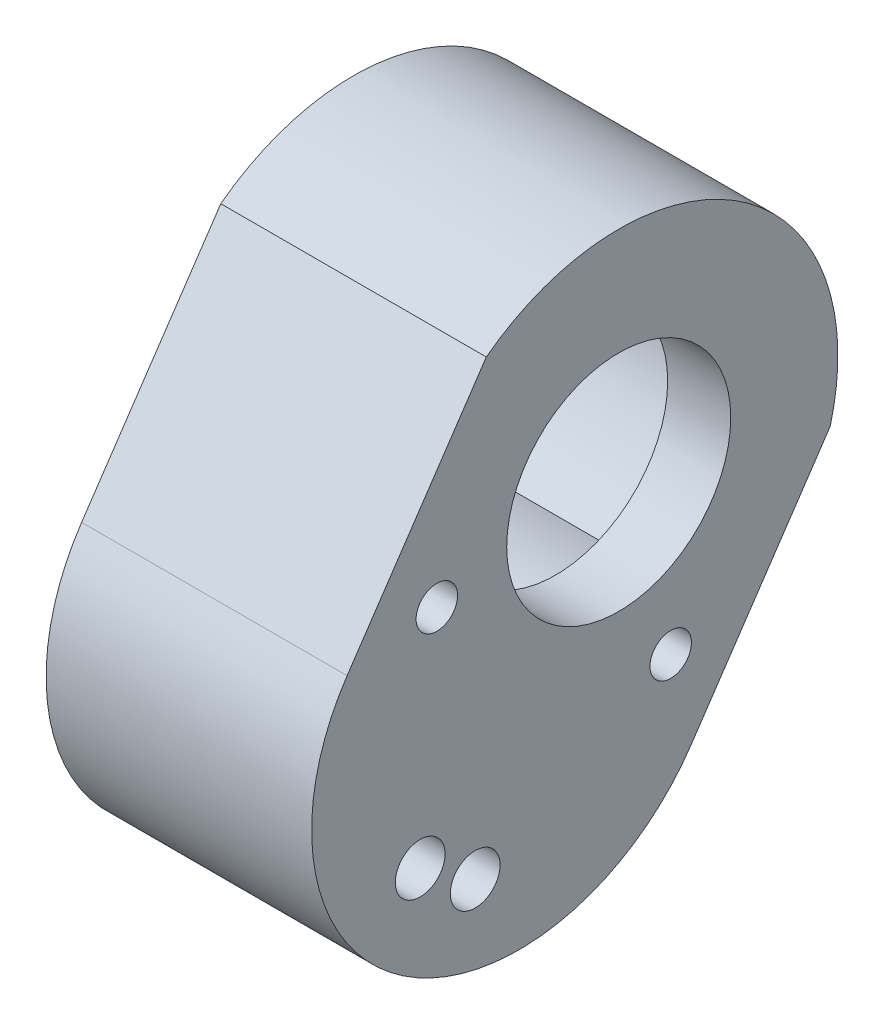
ISO-10303-21;
HEADER;
FILE_DESCRIPTION(('STEP AP214'),'2;1');
FILE_NAME('part.step','',(''),(''),'','','');
FILE_SCHEMA(('AUTOMOTIVE_DESIGN { 1 0 10303 214 1 1 1 1 }'));
ENDSEC;
DATA;
#1=APPLICATION_CONTEXT('core data for automotive mechanical design processes');
#2=APPLICATION_PROTOCOL_DEFINITION('international standard','automotive_design',2000,#1);
#3=PRODUCT_CONTEXT('',#1,'mechanical');
#4=PRODUCT('Part','Part','',(#3));
#5=PRODUCT_RELATED_PRODUCT_CATEGORY('part','',(#4));
#6=PRODUCT_DEFINITION_FORMATION('','',#4);
#7=PRODUCT_DEFINITION_CONTEXT('part definition',#1,'design');
#8=PRODUCT_DEFINITION('design','',#6,#7);
#9=PRODUCT_DEFINITION_SHAPE('','',#8);
#10=(LENGTH_UNIT() NAMED_UNIT(*) SI_UNIT(.MILLI.,.METRE.));
#11=(NAMED_UNIT(*) PLANE_ANGLE_UNIT() SI_UNIT($,.RADIAN.));
#12=(NAMED_UNIT(*) SI_UNIT($,.STERADIAN.) SOLID_ANGLE_UNIT());
#13=UNCERTAINTY_MEASURE_WITH_UNIT(LENGTH_MEASURE(1.E-05),#10,'distance_accuracy_value','');
#14=(GEOMETRIC_REPRESENTATION_CONTEXT(3) GLOBAL_UNCERTAINTY_ASSIGNED_CONTEXT((#13)) GLOBAL_UNIT_ASSIGNED_CONTEXT((#10,
#11,#12)) REPRESENTATION_CONTEXT('',''));
#15=CARTESIAN_POINT('',(0.,0.,0.));
#16=DIRECTION('',(0.,0.,1.));
#17=DIRECTION('',(1.,0.,0.));
#18=AXIS2_PLACEMENT_3D('',#15,#16,#17);
#19=CARTESIAN_POINT('',(3.5,40.5189022157069,-29.0836161889742));
#20=DIRECTION('',(-1.,0.,0.));
#21=DIRECTION('',(0.,0.,1.));
#22=AXIS2_PLACEMENT_3D('',#19,#20,#21);
#23=PLANE('',#22);
#24=CARTESIAN_POINT('',(3.5,30.0199646853968,-19.5895575099757));
#25=DIRECTION('',(-1.,0.,0.));
#26=DIRECTION('',(0.,0.,1.));
#27=AXIS2_PLACEMENT_3D('',#24,#25,#26);
#28=CIRCLE('',#27,1.5);
#29=CARTESIAN_POINT('',(3.5,28.7059982704708,-20.3130851600669));
#30=VERTEX_POINT('',#29);
#31=CARTESIAN_POINT('',(3.5,28.9737618715736,-18.5146344093083));
#32=VERTEX_POINT('',#31);
#33=EDGE_CURVE('E146',#30,#32,#28,.T.);
#34=ORIENTED_EDGE('',*,*,#33,.F.);
#35=CARTESIAN_POINT('',(3.5,36.855156402375,-26.6123884343361));
#36=DIRECTION('',(-1.,0.,0.));
#37=DIRECTION('',(0.,0.,1.));
#38=AXIS2_PLACEMENT_3D('',#35,#36,#37);
#39=CIRCLE('',#38,10.3);
#40=CARTESIAN_POINT('',(3.5,27.9618157444527,-21.4163811265906));
#41=VERTEX_POINT('',#40);
#42=EDGE_CURVE('E167',#41,#30,#39,.T.);
#43=ORIENTED_EDGE('',*,*,#42,.F.);
#44=CARTESIAN_POINT('',(3.5,27.7831930715139,-22.9057078001959));
#45=DIRECTION('',(-1.,0.,0.));
#46=DIRECTION('',(0.,0.,1.));
#47=AXIS2_PLACEMENT_3D('',#44,#45,#46);
#48=CIRCLE('',#47,1.5);
#49=CARTESIAN_POINT('',(3.5,26.3946272555657,-22.3383587235418));
#50=VERTEX_POINT('',#49);
#51=EDGE_CURVE('E58',#50,#41,#48,.T.);
#52=ORIENTED_EDGE('',*,*,#51,.F.);
#53=CARTESIAN_POINT('',(3.5,36.855156402375,-26.6123884343361));
#54=DIRECTION('',(-1.,0.,0.));
#55=DIRECTION('',(0.,0.,1.));
#56=AXIS2_PLACEMENT_3D('',#53,#54,#55);
#57=CIRCLE('',#56,11.3);
#58=EDGE_CURVE('E186',#50,#32,#57,.T.);
#59=ORIENTED_EDGE('',*,*,#58,.T.);
#60=EDGE_LOOP('',(#34,#43,#52,#59));
#61=FACE_BOUND('',#60,.T.);
#62=ADVANCED_FACE('F35',(#61),#23,.T.);
#63=CARTESIAN_POINT('',(3.5,36.855156402375,-26.6123884343361));
#64=DIRECTION('',(1.,0.,0.));
#65=DIRECTION('',(0.,0.,-1.));
#66=AXIS2_PLACEMENT_3D('',#63,#64,#65);
#67=CYLINDRICAL_SURFACE('',#66,10.3);
#68=DIRECTION('',(-1.,0.,0.));
#69=VECTOR('',#68,1.);
#70=CARTESIAN_POINT('',(9.3,28.7059982704708,-20.3130851600669));
#71=LINE('',#70,#69);
#72=CARTESIAN_POINT('',(13.5,28.7059982704708,-20.3130851600669));
#73=VERTEX_POINT('',#72);
#74=EDGE_CURVE('E11',#73,#30,#71,.T.);
#75=ORIENTED_EDGE('',*,*,#74,.F.);
#76=CARTESIAN_POINT('',(13.5,36.855156402375,-26.6123884343361));
#77=DIRECTION('',(-1.,0.,0.));
#78=DIRECTION('',(0.,0.,1.));
#79=AXIS2_PLACEMENT_3D('',#76,#77,#78);
#80=CIRCLE('',#79,10.3);
#81=CARTESIAN_POINT('',(13.5,27.9618157444527,-21.4163811265906));
#82=VERTEX_POINT('',#81);
#83=EDGE_CURVE('E144',#82,#73,#80,.T.);
#84=ORIENTED_EDGE('',*,*,#83,.F.);
#85=DIRECTION('',(-1.,0.,0.));
#86=VECTOR('',#85,1.);
#87=CARTESIAN_POINT('',(9.3,27.9618157444527,-21.4163811265906));
#88=LINE('',#87,#86);
#89=EDGE_CURVE('E181',#41,#82,#88,.F.);
#90=ORIENTED_EDGE('',*,*,#89,.F.);
#91=ORIENTED_EDGE('',*,*,#42,.T.);
#92=EDGE_LOOP('',(#75,#84,#90,#91));
#93=FACE_BOUND('',#92,.T.);
#94=ADVANCED_FACE('F180',(#93),#67,.F.);
#95=DIRECTION('',(-1.,0.,0.));
#96=VECTOR('',#95,1.);
#97=CARTESIAN_POINT('',(9.3,26.8677803737862,-24.093992106597));
#98=LINE('',#97,#96);
#99=CARTESIAN_POINT('',(13.5,26.8677803737862,-24.093992106597));
#100=VERTEX_POINT('',#99);
#101=CARTESIAN_POINT('',(3.5,26.8677803737862,-24.093992106597));
#102=VERTEX_POINT('',#101);
#103=EDGE_CURVE('E134',#100,#102,#98,.T.);
#104=ORIENTED_EDGE('',*,*,#103,.F.);
#105=CARTESIAN_POINT('',(13.5,35.316304149648,-36.7967850165729));
#106=VERTEX_POINT('',#105);
#107=EDGE_CURVE('E154',#106,#100,#80,.T.);
#108=ORIENTED_EDGE('',*,*,#107,.F.);
#109=DIRECTION('',(1.,0.,0.));
#110=VECTOR('',#109,1.);
#111=CARTESIAN_POINT('',(3.5,35.316304149648,-36.7967850165729));
#112=LINE('',#111,#110);
#113=CARTESIAN_POINT('',(3.5,35.316304149648,-36.7967850165729));
#114=VERTEX_POINT('',#113);
#115=EDGE_CURVE('E176',#114,#106,#112,.T.);
#116=ORIENTED_EDGE('',*,*,#115,.F.);
#117=EDGE_CURVE('E169',#114,#102,#39,.T.);
#118=ORIENTED_EDGE('',*,*,#117,.T.);
#119=EDGE_LOOP('',(#104,#108,#116,#118));
#120=FACE_BOUND('',#119,.T.);
#121=ADVANCED_FACE('F219',(#120),#67,.F.);
#122=CARTESIAN_POINT('',(17.3,35.2795403446043,-25.5496219840961));
#123=DIRECTION('',(1.,0.,0.));
#124=DIRECTION('',(0.,0.,-1.));
#125=AXIS2_PLACEMENT_3D('',#122,#123,#124);
#126=PLANE('',#125);
#127=CARTESIAN_POINT('',(17.3,30.0199646853968,-19.5895575099757));
#128=DIRECTION('',(-1.,0.,0.));
#129=DIRECTION('',(0.,0.,-1.));
#130=AXIS2_PLACEMENT_3D('',#127,#128,#129);
#131=CIRCLE('',#130,1.5);
#132=CARTESIAN_POINT('',(17.3,30.0199646853968,-21.0895575099757));
#133=VERTEX_POINT('',#132);
#134=EDGE_CURVE('E188',#133,#133,#131,.T.);
#135=ORIENTED_EDGE('',*,*,#134,.T.);
#136=EDGE_LOOP('',(#135));
#137=FACE_BOUND('',#136,.T.);
#138=CARTESIAN_POINT('',(17.3,43.1325247006547,-20.5936742525992));
#139=DIRECTION('',(-1.,0.,0.));
#140=DIRECTION('',(0.,0.,-1.));
#141=AXIS2_PLACEMENT_3D('',#138,#139,#140);
#142=CIRCLE('',#141,1.25);
#143=CARTESIAN_POINT('',(17.3,43.1325247006547,-21.8436742525992));
#144=VERTEX_POINT('',#143);
#145=EDGE_CURVE('E145',#144,#144,#142,.T.);
#146=ORIENTED_EDGE('',*,*,#145,.T.);
#147=EDGE_LOOP('',(#146));
#148=FACE_BOUND('',#147,.T.);
#149=CARTESIAN_POINT('',(17.3,27.7831930715139,-22.9057078001959));
#150=DIRECTION('',(-1.,0.,0.));
#151=DIRECTION('',(0.,0.,1.));
#152=AXIS2_PLACEMENT_3D('',#149,#150,#151);
#153=CIRCLE('',#152,1.5);
#154=CARTESIAN_POINT('',(17.3,27.7831930715139,-21.4057078001959));
#155=VERTEX_POINT('',#154);
#156=EDGE_CURVE('E194',#155,#155,#153,.T.);
#157=ORIENTED_EDGE('',*,*,#156,.T.);
#158=EDGE_LOOP('',(#157));
#159=FACE_BOUND('',#158,.T.);
#160=CARTESIAN_POINT('',(17.3,33.6262453416521,-34.6873129860349));
#161=DIRECTION('',(-1.,0.,0.));
#162=DIRECTION('',(0.,0.,1.));
#163=AXIS2_PLACEMENT_3D('',#160,#161,#162);
#164=CIRCLE('',#163,1.25);
#165=CARTESIAN_POINT('',(17.3,33.6262453416521,-33.4373129860349));
#166=VERTEX_POINT('',#165);
#167=EDGE_CURVE('E171',#166,#166,#164,.T.);
#168=ORIENTED_EDGE('',*,*,#167,.T.);
#169=EDGE_LOOP('',(#168));
#170=FACE_BOUND('',#169,.T.);
#171=DIRECTION('',(0.,-0.829037572555044,0.559192903470744));
#172=VECTOR('',#171,1.);
#173=CARTESIAN_POINT('',(17.3,54.7050152263143,-23.5745458792192));
#174=LINE('',#173,#172);
#175=CARTESIAN_POINT('',(17.3,54.7050152263143,-23.5745458792192));
#176=VERTEX_POINT('',#175);
#177=CARTESIAN_POINT('',(17.3,42.2694516379887,-15.1866523271581));
#178=VERTEX_POINT('',#177);
#179=EDGE_CURVE('E317',#176,#178,#174,.T.);
#180=ORIENTED_EDGE('',*,*,#179,.T.);
#181=CARTESIAN_POINT('',(17.3,35.2795403446043,-25.5496219840961));
#182=DIRECTION('',(1.,0.,0.));
#183=DIRECTION('',(0.,0.,-1.));
#184=AXIS2_PLACEMENT_3D('',#181,#182,#183);
#185=CIRCLE('',#184,12.5);
#186=CARTESIAN_POINT('',(17.3,28.28962905122,-35.9125916410341));
#187=VERTEX_POINT('',#186);
#188=EDGE_CURVE('E357',#178,#187,#185,.T.);
#189=ORIENTED_EDGE('',*,*,#188,.T.);
#190=DIRECTION('',(0.,0.829037572555044,-0.559192903470744));
#191=VECTOR('',#190,1.);
#192=CARTESIAN_POINT('',(17.3,28.28962905122,-35.9125916410341));
#193=LINE('',#192,#191);
#194=CARTESIAN_POINT('',(17.3,40.7251926395457,-44.3004851930953));
#195=VERTEX_POINT('',#194);
#196=EDGE_CURVE('E310',#187,#195,#193,.T.);
#197=ORIENTED_EDGE('',*,*,#196,.T.);
#198=CARTESIAN_POINT('',(17.3,44.1826480290387,-31.5548439436123));
#199=DIRECTION('',(-1.,0.,0.));
#200=DIRECTION('',(0.,0.,1.));
#201=AXIS2_PLACEMENT_3D('',#198,#199,#200);
#202=CIRCLE('',#201,13.206262477736);
#203=EDGE_CURVE('E323',#176,#195,#202,.T.);
#204=ORIENTED_EDGE('',*,*,#203,.F.);
#205=EDGE_LOOP('',(#180,#189,#197,#204));
#206=FACE_BOUND('',#205,.T.);
#207=CARTESIAN_POINT('',(17.3,44.1826480290387,-31.5548439436123));
#208=DIRECTION('',(1.,0.,0.));
#209=DIRECTION('',(0.,0.,-1.));
#210=AXIS2_PLACEMENT_3D('',#207,#208,#209);
#211=CIRCLE('',#210,6.75);
#212=CARTESIAN_POINT('',(17.3,44.1826480290387,-38.3048439436123));
#213=VERTEX_POINT('',#212);
#214=EDGE_CURVE('E214',#213,#213,#211,.T.);
#215=ORIENTED_EDGE('',*,*,#214,.F.);
#216=EDGE_LOOP('',(#215));
#217=FACE_BOUND('',#216,.T.);
#218=ADVANCED_FACE('F269',(#137,#148,#159,#170,#206,#217),#126,.T.);
#219=CARTESIAN_POINT('',(13.5,40.5189022157069,-29.0836161889742));
#220=DIRECTION('',(1.,0.,0.));
#221=DIRECTION('',(0.,0.,-1.));
#222=AXIS2_PLACEMENT_3D('',#219,#220,#221);
#223=PLANE('',#222);
#224=CARTESIAN_POINT('',(13.5,43.1325247006547,-20.5936742525992));
#225=DIRECTION('',(1.,0.,0.));
#226=DIRECTION('',(0.,0.,-1.));
#227=AXIS2_PLACEMENT_3D('',#224,#225,#226);
#228=CIRCLE('',#227,1.25);
#229=CARTESIAN_POINT('',(13.5,43.1325247006547,-21.8436742525992));
#230=VERTEX_POINT('',#229);
#231=EDGE_CURVE('E193',#230,#230,#228,.T.);
#232=ORIENTED_EDGE('',*,*,#231,.T.);
#233=EDGE_LOOP('',(#232));
#234=FACE_BOUND('',#233,.T.);
#235=CARTESIAN_POINT('',(13.5,33.6262453416521,-34.6873129860349));
#236=DIRECTION('',(1.,0.,0.));
#237=DIRECTION('',(0.,0.,-1.));
#238=AXIS2_PLACEMENT_3D('',#235,#236,#237);
#239=CIRCLE('',#238,1.25);
#240=CARTESIAN_POINT('',(13.5,33.6262453416521,-35.9373129860349));
#241=VERTEX_POINT('',#240);
#242=EDGE_CURVE('E155',#241,#241,#239,.T.);
#243=ORIENTED_EDGE('',*,*,#242,.T.);
#244=EDGE_LOOP('',(#243));
#245=FACE_BOUND('',#244,.T.);
#246=ORIENTED_EDGE('',*,*,#83,.T.);
#247=CARTESIAN_POINT('',(13.5,30.0199646853968,-19.5895575099757));
#248=DIRECTION('',(1.,0.,0.));
#249=DIRECTION('',(0.,0.,-1.));
#250=AXIS2_PLACEMENT_3D('',#247,#248,#249);
#251=CIRCLE('',#250,1.5);
#252=CARTESIAN_POINT('',(13.5,30.7788030766616,-18.2956625003468));
#253=VERTEX_POINT('',#252);
#254=EDGE_CURVE('E129',#73,#253,#251,.T.);
#255=ORIENTED_EDGE('',*,*,#254,.T.);
#256=CARTESIAN_POINT('',(13.5,45.7215002817657,-21.3704473613754));
#257=VERTEX_POINT('',#256);
#258=EDGE_CURVE('E140',#253,#257,#80,.T.);
#259=ORIENTED_EDGE('',*,*,#258,.T.);
#260=CARTESIAN_POINT('',(13.5,44.1826480290387,-31.5548439436123));
#261=DIRECTION('',(-1.,0.,0.));
#262=DIRECTION('',(0.,0.,1.));
#263=AXIS2_PLACEMENT_3D('',#260,#261,#262);
#264=CIRCLE('',#263,10.3);
#265=EDGE_CURVE('E152',#257,#106,#264,.T.);
#266=ORIENTED_EDGE('',*,*,#265,.T.);
#267=ORIENTED_EDGE('',*,*,#107,.T.);
#268=CARTESIAN_POINT('',(13.5,27.7831930715139,-22.9057078001959));
#269=DIRECTION('',(1.,0.,0.));
#270=DIRECTION('',(0.,0.,-1.));
#271=AXIS2_PLACEMENT_3D('',#268,#269,#270);
#272=CIRCLE('',#271,1.5);
#273=EDGE_CURVE('E198',#100,#82,#272,.T.);
#274=ORIENTED_EDGE('',*,*,#273,.T.);
#275=EDGE_LOOP('',(#246,#255,#259,#266,#267,#274));
#276=FACE_BOUND('',#275,.T.);
#277=CARTESIAN_POINT('',(13.5,44.1826480290387,-31.5548439436123));
#278=DIRECTION('',(1.,0.,0.));
#279=DIRECTION('',(0.,0.,-1.));
#280=AXIS2_PLACEMENT_3D('',#277,#278,#279);
#281=CIRCLE('',#280,6.75);
#282=CARTESIAN_POINT('',(13.5,44.1826480290387,-38.3048439436123));
#283=VERTEX_POINT('',#282);
#284=EDGE_CURVE('E330',#283,#283,#281,.F.);
#285=ORIENTED_EDGE('',*,*,#284,.F.);
#286=EDGE_LOOP('',(#285));
#287=FACE_BOUND('',#286,.T.);
#288=ADVANCED_FACE('F137',(#234,#245,#276,#287),#223,.F.);
#289=CARTESIAN_POINT('',(1.3,35.2795403446043,-25.5496219840961));
#290=DIRECTION('',(1.,0.,0.));
#291=DIRECTION('',(0.,0.,-1.));
#292=AXIS2_PLACEMENT_3D('',#289,#290,#291);
#293=PLANE('',#292);
#294=DIRECTION('',(0.,-0.829037572555044,0.559192903470744));
#295=VECTOR('',#294,1.);
#296=CARTESIAN_POINT('',(1.3,54.7050152263143,-23.5745458792192));
#297=LINE('',#296,#295);
#298=CARTESIAN_POINT('',(1.3,54.7050152263143,-23.5745458792192));
#299=VERTEX_POINT('',#298);
#300=CARTESIAN_POINT('',(1.3,42.2694516379887,-15.1866523271581));
#301=VERTEX_POINT('',#300);
#302=EDGE_CURVE('E305',#299,#301,#297,.T.);
#303=ORIENTED_EDGE('',*,*,#302,.F.);
#304=CARTESIAN_POINT('',(1.3,44.1826480290387,-31.5548439436123));
#305=DIRECTION('',(-1.,0.,0.));
#306=DIRECTION('',(0.,0.,1.));
#307=AXIS2_PLACEMENT_3D('',#304,#305,#306);
#308=CIRCLE('',#307,13.206262477736);
#309=CARTESIAN_POINT('',(1.3,40.7251926395457,-44.3004851930953));
#310=VERTEX_POINT('',#309);
#311=EDGE_CURVE('E315',#299,#310,#308,.T.);
#312=ORIENTED_EDGE('',*,*,#311,.T.);
#313=DIRECTION('',(0.,0.829037572555044,-0.559192903470744));
#314=VECTOR('',#313,1.);
#315=CARTESIAN_POINT('',(1.3,28.28962905122,-35.9125916410341));
#316=LINE('',#315,#314);
#317=CARTESIAN_POINT('',(1.3,28.28962905122,-35.9125916410341));
#318=VERTEX_POINT('',#317);
#319=EDGE_CURVE('E304',#318,#310,#316,.T.);
#320=ORIENTED_EDGE('',*,*,#319,.F.);
#321=CARTESIAN_POINT('',(1.3,35.2795403446043,-25.5496219840961));
#322=DIRECTION('',(1.,0.,0.));
#323=DIRECTION('',(0.,0.,-1.));
#324=AXIS2_PLACEMENT_3D('',#321,#322,#323);
#325=CIRCLE('',#324,12.5);
#326=EDGE_CURVE('E295',#301,#318,#325,.T.);
#327=ORIENTED_EDGE('',*,*,#326,.F.);
#328=EDGE_LOOP('',(#303,#312,#320,#327));
#329=FACE_BOUND('',#328,.T.);
#330=CARTESIAN_POINT('',(1.3,36.855156402375,-26.6123884343361));
#331=DIRECTION('',(1.,0.,0.));
#332=DIRECTION('',(0.,0.,-1.));
#333=AXIS2_PLACEMENT_3D('',#330,#331,#332);
#334=CIRCLE('',#333,11.3);
#335=CARTESIAN_POINT('',(1.3,34.7032960196111,-37.7056069435466));
#336=VERTEX_POINT('',#335);
#337=CARTESIAN_POINT('',(1.3,46.3345084118026,-20.4616254344017));
#338=VERTEX_POINT('',#337);
#339=EDGE_CURVE('E221',#336,#338,#334,.F.);
#340=ORIENTED_EDGE('',*,*,#339,.F.);
#341=CARTESIAN_POINT('',(1.3,44.1826480290387,-31.5548439436123));
#342=DIRECTION('',(1.,0.,0.));
#343=DIRECTION('',(0.,0.,-1.));
#344=AXIS2_PLACEMENT_3D('',#341,#342,#343);
#345=CIRCLE('',#344,11.3);
#346=EDGE_CURVE('E326',#336,#338,#345,.T.);
#347=ORIENTED_EDGE('',*,*,#346,.T.);
#348=EDGE_LOOP('',(#340,#347));
#349=FACE_BOUND('',#348,.T.);
#350=ADVANCED_FACE('F268',(#329,#349),#293,.F.);
#351=CARTESIAN_POINT('',(17.3,54.7050152263143,-23.5745458792192));
#352=DIRECTION('',(0.,-0.559192903470744,-0.829037572555044));
#353=DIRECTION('',(0.,0.829037572555044,-0.559192903470744));
#354=AXIS2_PLACEMENT_3D('',#351,#352,#353);
#355=PLANE('',#354);
#356=ORIENTED_EDGE('',*,*,#302,.T.);
#357=DIRECTION('',(-1.,0.,0.));
#358=VECTOR('',#357,1.);
#359=CARTESIAN_POINT('',(17.3,42.2694516379887,-15.1866523271581));
#360=LINE('',#359,#358);
#361=EDGE_CURVE('E300',#178,#301,#360,.T.);
#362=ORIENTED_EDGE('',*,*,#361,.F.);
#363=ORIENTED_EDGE('',*,*,#179,.F.);
#364=DIRECTION('',(-1.,0.,0.));
#365=VECTOR('',#364,1.);
#366=CARTESIAN_POINT('',(17.3,54.7050152263143,-23.5745458792192));
#367=LINE('',#366,#365);
#368=EDGE_CURVE('E321',#176,#299,#367,.T.);
#369=ORIENTED_EDGE('',*,*,#368,.T.);
#370=EDGE_LOOP('',(#356,#362,#363,#369));
#371=FACE_BOUND('',#370,.T.);
#372=ADVANCED_FACE('F37',(#371),#355,.F.);
#373=CARTESIAN_POINT('',(17.3,35.2795403446043,-25.5496219840961));
#374=DIRECTION('',(-1.,0.,0.));
#375=DIRECTION('',(0.,0.,1.));
#376=AXIS2_PLACEMENT_3D('',#373,#374,#375);
#377=CYLINDRICAL_SURFACE('',#376,12.5);
#378=ORIENTED_EDGE('',*,*,#326,.T.);
#379=DIRECTION('',(-1.,0.,0.));
#380=VECTOR('',#379,1.);
#381=CARTESIAN_POINT('',(17.3,28.28962905122,-35.9125916410341));
#382=LINE('',#381,#380);
#383=EDGE_CURVE('E297',#187,#318,#382,.T.);
#384=ORIENTED_EDGE('',*,*,#383,.F.);
#385=ORIENTED_EDGE('',*,*,#188,.F.);
#386=ORIENTED_EDGE('',*,*,#361,.T.);
#387=EDGE_LOOP('',(#378,#384,#385,#386));
#388=FACE_BOUND('',#387,.T.);
#389=ADVANCED_FACE('F285',(#388),#377,.T.);
#390=CARTESIAN_POINT('',(17.3,28.28962905122,-35.9125916410341));
#391=DIRECTION('',(0.,0.559192903470744,0.829037572555044));
#392=DIRECTION('',(0.,-0.829037572555044,0.559192903470744));
#393=AXIS2_PLACEMENT_3D('',#390,#391,#392);
#394=PLANE('',#393);
#395=ORIENTED_EDGE('',*,*,#319,.T.);
#396=DIRECTION('',(-1.,0.,0.));
#397=VECTOR('',#396,1.);
#398=CARTESIAN_POINT('',(17.3,40.7251926395457,-44.3004851930953));
#399=LINE('',#398,#397);
#400=EDGE_CURVE('E311',#195,#310,#399,.T.);
#401=ORIENTED_EDGE('',*,*,#400,.F.);
#402=ORIENTED_EDGE('',*,*,#196,.F.);
#403=ORIENTED_EDGE('',*,*,#383,.T.);
#404=EDGE_LOOP('',(#395,#401,#402,#403));
#405=FACE_BOUND('',#404,.T.);
#406=ADVANCED_FACE('F282',(#405),#394,.F.);
#407=CARTESIAN_POINT('',(17.3,44.1826480290387,-31.5548439436123));
#408=DIRECTION('',(-1.,0.,0.));
#409=DIRECTION('',(0.,0.,1.));
#410=AXIS2_PLACEMENT_3D('',#407,#408,#409);
#411=CYLINDRICAL_SURFACE('',#410,13.206262477736);
#412=ORIENTED_EDGE('',*,*,#311,.F.);
#413=ORIENTED_EDGE('',*,*,#368,.F.);
#414=ORIENTED_EDGE('',*,*,#203,.T.);
#415=ORIENTED_EDGE('',*,*,#400,.T.);
#416=EDGE_LOOP('',(#412,#413,#414,#415));
#417=FACE_BOUND('',#416,.T.);
#418=ADVANCED_FACE('F273',(#417),#411,.T.);
#419=CARTESIAN_POINT('',(13.5,36.855156402375,-26.6123884343361));
#420=DIRECTION('',(-1.,0.,0.));
#421=DIRECTION('',(0.,0.,1.));
#422=AXIS2_PLACEMENT_3D('',#419,#420,#421);
#423=CYLINDRICAL_SURFACE('',#422,11.3);
#424=ORIENTED_EDGE('',*,*,#339,.T.);
#425=DIRECTION('',(-1.,0.,0.));
#426=VECTOR('',#425,1.);
#427=CARTESIAN_POINT('',(13.5,46.3345084118026,-20.4616254344017));
#428=LINE('',#427,#426);
#429=CARTESIAN_POINT('',(3.5,46.3345084118026,-20.4616254344017));
#430=VERTEX_POINT('',#429);
#431=EDGE_CURVE('E332',#430,#338,#428,.T.);
#432=ORIENTED_EDGE('',*,*,#431,.F.);
#433=EDGE_CURVE('E213',#32,#430,#57,.T.);
#434=ORIENTED_EDGE('',*,*,#433,.F.);
#435=ORIENTED_EDGE('',*,*,#58,.F.);
#436=CARTESIAN_POINT('',(3.5,34.7032960196111,-37.7056069435466));
#437=VERTEX_POINT('',#436);
#438=EDGE_CURVE('E207',#437,#50,#57,.T.);
#439=ORIENTED_EDGE('',*,*,#438,.F.);
#440=DIRECTION('',(-1.,0.,0.));
#441=VECTOR('',#440,1.);
#442=CARTESIAN_POINT('',(13.5,34.7032960196111,-37.7056069435466));
#443=LINE('',#442,#441);
#444=EDGE_CURVE('E354',#437,#336,#443,.T.);
#445=ORIENTED_EDGE('',*,*,#444,.T.);
#446=EDGE_LOOP('',(#424,#432,#434,#435,#439,#445));
#447=FACE_BOUND('',#446,.T.);
#448=ADVANCED_FACE('F261',(#447),#423,.F.);
#449=CARTESIAN_POINT('',(13.5,44.1826480290387,-31.5548439436123));
#450=DIRECTION('',(-1.,0.,0.));
#451=DIRECTION('',(0.,0.,1.));
#452=AXIS2_PLACEMENT_3D('',#449,#450,#451);
#453=CYLINDRICAL_SURFACE('',#452,11.3);
#454=ORIENTED_EDGE('',*,*,#444,.F.);
#455=CARTESIAN_POINT('',(3.5,44.1826480290387,-31.5548439436123));
#456=DIRECTION('',(-1.,0.,0.));
#457=DIRECTION('',(0.,0.,1.));
#458=AXIS2_PLACEMENT_3D('',#455,#456,#457);
#459=CIRCLE('',#458,11.3);
#460=EDGE_CURVE('E209',#430,#437,#459,.T.);
#461=ORIENTED_EDGE('',*,*,#460,.F.);
#462=ORIENTED_EDGE('',*,*,#431,.T.);
#463=ORIENTED_EDGE('',*,*,#346,.F.);
#464=EDGE_LOOP('',(#454,#461,#462,#463));
#465=FACE_BOUND('',#464,.T.);
#466=ADVANCED_FACE('F256',(#465),#453,.F.);
#467=CARTESIAN_POINT('',(17.3,44.1826480290387,-31.5548439436123));
#468=DIRECTION('',(-1.,0.,0.));
#469=DIRECTION('',(0.,0.,1.));
#470=AXIS2_PLACEMENT_3D('',#467,#468,#469);
#471=CYLINDRICAL_SURFACE('',#470,6.75);
#472=ORIENTED_EDGE('',*,*,#214,.T.);
#473=EDGE_LOOP('',(#472));
#474=FACE_BOUND('',#473,.T.);
#475=ORIENTED_EDGE('',*,*,#284,.T.);
#476=EDGE_LOOP('',(#475));
#477=FACE_BOUND('',#476,.T.);
#478=ADVANCED_FACE('F251',(#474,#477),#471,.F.);
#479=CARTESIAN_POINT('',(3.5,30.7788030766616,-18.2956625003468));
#480=VERTEX_POINT('',#479);
#481=EDGE_CURVE('E50',#32,#480,#28,.T.);
#482=ORIENTED_EDGE('',*,*,#481,.F.);
#483=ORIENTED_EDGE('',*,*,#433,.T.);
#484=ORIENTED_EDGE('',*,*,#460,.T.);
#485=ORIENTED_EDGE('',*,*,#438,.T.);
#486=EDGE_CURVE('E197',#102,#50,#48,.T.);
#487=ORIENTED_EDGE('',*,*,#486,.F.);
#488=ORIENTED_EDGE('',*,*,#117,.F.);
#489=CARTESIAN_POINT('',(3.5,44.1826480290387,-31.5548439436123));
#490=DIRECTION('',(-1.,0.,0.));
#491=DIRECTION('',(0.,0.,1.));
#492=AXIS2_PLACEMENT_3D('',#489,#490,#491);
#493=CIRCLE('',#492,10.3);
#494=CARTESIAN_POINT('',(3.5,45.7215002817657,-21.3704473613754));
#495=VERTEX_POINT('',#494);
#496=EDGE_CURVE('E159',#495,#114,#493,.T.);
#497=ORIENTED_EDGE('',*,*,#496,.F.);
#498=EDGE_CURVE('E161',#480,#495,#39,.T.);
#499=ORIENTED_EDGE('',*,*,#498,.F.);
#500=EDGE_LOOP('',(#482,#483,#484,#485,#487,#488,#497,#499));
#501=FACE_BOUND('',#500,.T.);
#502=ADVANCED_FACE('F205',(#501),#23,.T.);
#503=CARTESIAN_POINT('',(3.5,44.1826480290387,-31.5548439436123));
#504=DIRECTION('',(1.,0.,0.));
#505=DIRECTION('',(0.,0.,-1.));
#506=AXIS2_PLACEMENT_3D('',#503,#504,#505);
#507=CYLINDRICAL_SURFACE('',#506,10.3);
#508=ORIENTED_EDGE('',*,*,#265,.F.);
#509=DIRECTION('',(1.,0.,0.));
#510=VECTOR('',#509,1.);
#511=CARTESIAN_POINT('',(3.5,45.7215002817657,-21.3704473613754));
#512=LINE('',#511,#510);
#513=EDGE_CURVE('E150',#495,#257,#512,.T.);
#514=ORIENTED_EDGE('',*,*,#513,.F.);
#515=ORIENTED_EDGE('',*,*,#496,.T.);
#516=ORIENTED_EDGE('',*,*,#115,.T.);
#517=EDGE_LOOP('',(#508,#514,#515,#516));
#518=FACE_BOUND('',#517,.T.);
#519=ADVANCED_FACE('F218',(#518),#507,.F.);
#520=DIRECTION('',(-1.,0.,0.));
#521=VECTOR('',#520,1.);
#522=CARTESIAN_POINT('',(9.3,30.7788030766616,-18.2956625003468));
#523=LINE('',#522,#521);
#524=EDGE_CURVE('E43',#480,#253,#523,.F.);
#525=ORIENTED_EDGE('',*,*,#524,.F.);
#526=ORIENTED_EDGE('',*,*,#498,.T.);
#527=ORIENTED_EDGE('',*,*,#513,.T.);
#528=ORIENTED_EDGE('',*,*,#258,.F.);
#529=EDGE_LOOP('',(#525,#526,#527,#528));
#530=FACE_BOUND('',#529,.T.);
#531=ADVANCED_FACE('F148',(#530),#67,.F.);
#532=CARTESIAN_POINT('',(17.3,33.6262453416521,-34.6873129860349));
#533=DIRECTION('',(-1.,0.,0.));
#534=DIRECTION('',(0.,0.,1.));
#535=AXIS2_PLACEMENT_3D('',#532,#533,#534);
#536=CYLINDRICAL_SURFACE('',#535,1.25);
#537=ORIENTED_EDGE('',*,*,#167,.F.);
#538=EDGE_LOOP('',(#537));
#539=FACE_BOUND('',#538,.T.);
#540=ORIENTED_EDGE('',*,*,#242,.F.);
#541=EDGE_LOOP('',(#540));
#542=FACE_BOUND('',#541,.T.);
#543=ADVANCED_FACE('F239',(#539,#542),#536,.F.);
#544=CARTESIAN_POINT('',(17.3,27.7831930715139,-22.9057078001959));
#545=DIRECTION('',(-1.,0.,0.));
#546=DIRECTION('',(0.,0.,1.));
#547=AXIS2_PLACEMENT_3D('',#544,#545,#546);
#548=CYLINDRICAL_SURFACE('',#547,1.5);
#549=ORIENTED_EDGE('',*,*,#103,.T.);
#550=ORIENTED_EDGE('',*,*,#486,.T.);
#551=ORIENTED_EDGE('',*,*,#51,.T.);
#552=ORIENTED_EDGE('',*,*,#89,.T.);
#553=ORIENTED_EDGE('',*,*,#273,.F.);
#554=EDGE_LOOP('',(#549,#550,#551,#552,#553));
#555=FACE_BOUND('',#554,.T.);
#556=ORIENTED_EDGE('',*,*,#156,.F.);
#557=EDGE_LOOP('',(#556));
#558=FACE_BOUND('',#557,.T.);
#559=ADVANCED_FACE('F201',(#555,#558),#548,.F.);
#560=CARTESIAN_POINT('',(17.3,43.1325247006547,-20.5936742525992));
#561=DIRECTION('',(-1.,0.,0.));
#562=DIRECTION('',(0.,0.,1.));
#563=AXIS2_PLACEMENT_3D('',#560,#561,#562);
#564=CYLINDRICAL_SURFACE('',#563,1.25);
#565=ORIENTED_EDGE('',*,*,#145,.F.);
#566=EDGE_LOOP('',(#565));
#567=FACE_BOUND('',#566,.T.);
#568=ORIENTED_EDGE('',*,*,#231,.F.);
#569=EDGE_LOOP('',(#568));
#570=FACE_BOUND('',#569,.T.);
#571=ADVANCED_FACE('F230',(#567,#570),#564,.F.);
#572=CARTESIAN_POINT('',(17.3,30.0199646853968,-19.5895575099757));
#573=DIRECTION('',(-1.,0.,0.));
#574=DIRECTION('',(0.,0.,1.));
#575=AXIS2_PLACEMENT_3D('',#572,#573,#574);
#576=CYLINDRICAL_SURFACE('',#575,1.5);
#577=ORIENTED_EDGE('',*,*,#74,.T.);
#578=ORIENTED_EDGE('',*,*,#33,.T.);
#579=ORIENTED_EDGE('',*,*,#481,.T.);
#580=ORIENTED_EDGE('',*,*,#524,.T.);
#581=ORIENTED_EDGE('',*,*,#254,.F.);
#582=EDGE_LOOP('',(#577,#578,#579,#580,#581));
#583=FACE_BOUND('',#582,.T.);
#584=ORIENTED_EDGE('',*,*,#134,.F.);
#585=EDGE_LOOP('',(#584));
#586=FACE_BOUND('',#585,.T.);
#587=ADVANCED_FACE('F127',(#583,#586),#576,.F.);
#588=CLOSED_SHELL('',(#62,#94,#121,#218,#288,#350,#372,#389,#406,#418,#448,#466,#478,#502,#519,
#531,#543,#559,#571,#587));
#589=MANIFOLD_SOLID_BREP('B2',#588);
#590=ADVANCED_BREP_SHAPE_REPRESENTATION('',(#18,#589),#14);
#591=SHAPE_DEFINITION_REPRESENTATION(#9,#590);
ENDSEC;
END-ISO-10303-21;
